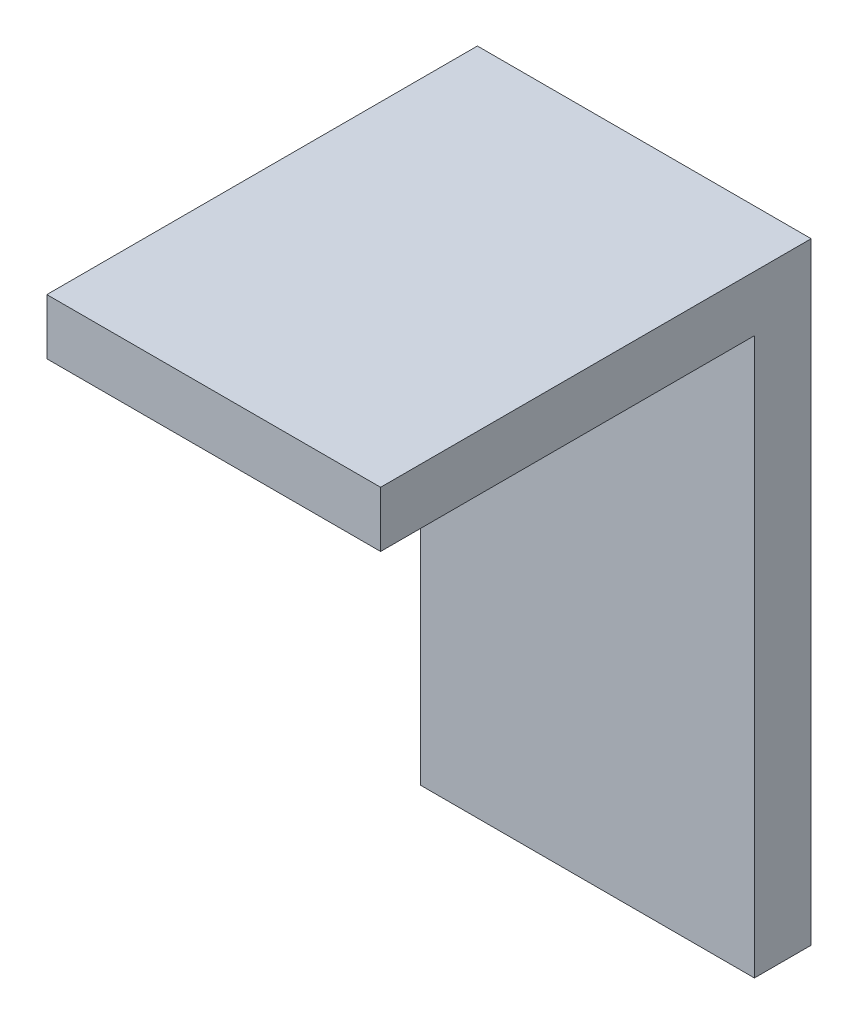
ISO-10303-21;
HEADER;
FILE_DESCRIPTION(('STEP AP214'),'2;1');
FILE_NAME('part.step','',(''),(''),'','','');
FILE_SCHEMA(('AUTOMOTIVE_DESIGN { 1 0 10303 214 1 1 1 1 }'));
ENDSEC;
DATA;
#1=APPLICATION_CONTEXT('core data for automotive mechanical design processes');
#2=APPLICATION_PROTOCOL_DEFINITION('international standard','automotive_design',2000,#1);
#3=PRODUCT_CONTEXT('',#1,'mechanical');
#4=PRODUCT('Part','Part','',(#3));
#5=PRODUCT_RELATED_PRODUCT_CATEGORY('part','',(#4));
#6=PRODUCT_DEFINITION_FORMATION('','',#4);
#7=PRODUCT_DEFINITION_CONTEXT('part definition',#1,'design');
#8=PRODUCT_DEFINITION('design','',#6,#7);
#9=PRODUCT_DEFINITION_SHAPE('','',#8);
#10=(LENGTH_UNIT() NAMED_UNIT(*) SI_UNIT(.MILLI.,.METRE.));
#11=(NAMED_UNIT(*) PLANE_ANGLE_UNIT() SI_UNIT($,.RADIAN.));
#12=(NAMED_UNIT(*) SI_UNIT($,.STERADIAN.) SOLID_ANGLE_UNIT());
#13=UNCERTAINTY_MEASURE_WITH_UNIT(LENGTH_MEASURE(1.E-05),#10,'distance_accuracy_value','');
#14=(GEOMETRIC_REPRESENTATION_CONTEXT(3) GLOBAL_UNCERTAINTY_ASSIGNED_CONTEXT((#13)) GLOBAL_UNIT_ASSIGNED_CONTEXT((#10,
#11,#12)) REPRESENTATION_CONTEXT('',''));
#15=CARTESIAN_POINT('',(0.,0.,0.));
#16=DIRECTION('',(0.,0.,1.));
#17=DIRECTION('',(1.,0.,0.));
#18=AXIS2_PLACEMENT_3D('',#15,#16,#17);
#19=CARTESIAN_POINT('',(-3.4,4.55,0.));
#20=DIRECTION('',(-1.,0.,0.));
#21=DIRECTION('',(0.,0.,1.));
#22=AXIS2_PLACEMENT_3D('',#19,#20,#21);
#23=PLANE('',#22);
#24=DIRECTION('',(0.,1.,0.));
#25=VECTOR('',#24,1.);
#26=CARTESIAN_POINT('',(-3.4,4.,0.));
#27=LINE('',#26,#25);
#28=CARTESIAN_POINT('',(-3.4,4.,0.));
#29=VERTEX_POINT('',#28);
#30=CARTESIAN_POINT('',(-3.4,4.55,0.));
#31=VERTEX_POINT('',#30);
#32=EDGE_CURVE('E11',#29,#31,#27,.T.);
#33=ORIENTED_EDGE('',*,*,#32,.F.);
#34=DIRECTION('',(0.,0.,-1.));
#35=VECTOR('',#34,1.);
#36=CARTESIAN_POINT('',(-3.4,4.,0.051));
#37=LINE('',#36,#35);
#38=CARTESIAN_POINT('',(-3.4,4.,0.051));
#39=VERTEX_POINT('',#38);
#40=EDGE_CURVE('E24',#39,#29,#37,.T.);
#41=ORIENTED_EDGE('',*,*,#40,.F.);
#42=DIRECTION('',(0.,-1.,0.));
#43=VECTOR('',#42,1.);
#44=CARTESIAN_POINT('',(-3.4,4.5,0.051));
#45=LINE('',#44,#43);
#46=CARTESIAN_POINT('',(-3.4,4.5,0.051));
#47=VERTEX_POINT('',#46);
#48=EDGE_CURVE('E87',#47,#39,#45,.T.);
#49=ORIENTED_EDGE('',*,*,#48,.F.);
#50=DIRECTION('',(0.,0.,-1.));
#51=VECTOR('',#50,1.);
#52=CARTESIAN_POINT('',(-3.4,4.5,0.387));
#53=LINE('',#52,#51);
#54=CARTESIAN_POINT('',(-3.4,4.5,0.387));
#55=VERTEX_POINT('',#54);
#56=EDGE_CURVE('E114',#55,#47,#53,.T.);
#57=ORIENTED_EDGE('',*,*,#56,.F.);
#58=DIRECTION('',(0.,-1.,0.));
#59=VECTOR('',#58,1.);
#60=CARTESIAN_POINT('',(-3.4,4.55,0.387));
#61=LINE('',#60,#59);
#62=CARTESIAN_POINT('',(-3.4,4.55,0.387));
#63=VERTEX_POINT('',#62);
#64=EDGE_CURVE('E111',#63,#55,#61,.T.);
#65=ORIENTED_EDGE('',*,*,#64,.F.);
#66=DIRECTION('',(0.,0.,1.));
#67=VECTOR('',#66,1.);
#68=CARTESIAN_POINT('',(-3.4,4.55,0.));
#69=LINE('',#68,#67);
#70=EDGE_CURVE('E108',#31,#63,#69,.T.);
#71=ORIENTED_EDGE('',*,*,#70,.F.);
#72=EDGE_LOOP('',(#33,#41,#49,#57,#65,#71));
#73=FACE_BOUND('',#72,.T.);
#74=ADVANCED_FACE('F17',(#73),#23,.T.);
#75=CARTESIAN_POINT('',(-3.1,4.,0.));
#76=DIRECTION('',(1.,0.,0.));
#77=DIRECTION('',(0.,0.,1.));
#78=AXIS2_PLACEMENT_3D('',#75,#76,#77);
#79=PLANE('',#78);
#80=DIRECTION('',(0.,-1.,0.));
#81=VECTOR('',#80,1.);
#82=CARTESIAN_POINT('',(-3.1,4.55,0.));
#83=LINE('',#82,#81);
#84=CARTESIAN_POINT('',(-3.1,4.55,0.));
#85=VERTEX_POINT('',#84);
#86=CARTESIAN_POINT('',(-3.1,4.,0.));
#87=VERTEX_POINT('',#86);
#88=EDGE_CURVE('E106',#85,#87,#83,.T.);
#89=ORIENTED_EDGE('',*,*,#88,.F.);
#90=DIRECTION('',(0.,0.,-1.));
#91=VECTOR('',#90,1.);
#92=CARTESIAN_POINT('',(-3.1,4.55,0.387));
#93=LINE('',#92,#91);
#94=CARTESIAN_POINT('',(-3.1,4.55,0.387));
#95=VERTEX_POINT('',#94);
#96=EDGE_CURVE('E103',#95,#85,#93,.T.);
#97=ORIENTED_EDGE('',*,*,#96,.F.);
#98=DIRECTION('',(0.,1.,0.));
#99=VECTOR('',#98,1.);
#100=CARTESIAN_POINT('',(-3.1,4.5,0.387));
#101=LINE('',#100,#99);
#102=CARTESIAN_POINT('',(-3.1,4.5,0.387));
#103=VERTEX_POINT('',#102);
#104=EDGE_CURVE('E100',#103,#95,#101,.T.);
#105=ORIENTED_EDGE('',*,*,#104,.F.);
#106=DIRECTION('',(0.,0.,1.));
#107=VECTOR('',#106,1.);
#108=CARTESIAN_POINT('',(-3.1,4.5,0.051));
#109=LINE('',#108,#107);
#110=CARTESIAN_POINT('',(-3.1,4.5,0.051));
#111=VERTEX_POINT('',#110);
#112=EDGE_CURVE('E72',#111,#103,#109,.T.);
#113=ORIENTED_EDGE('',*,*,#112,.F.);
#114=DIRECTION('',(0.,1.,0.));
#115=VECTOR('',#114,1.);
#116=CARTESIAN_POINT('',(-3.1,4.,0.051));
#117=LINE('',#116,#115);
#118=CARTESIAN_POINT('',(-3.1,4.,0.051));
#119=VERTEX_POINT('',#118);
#120=EDGE_CURVE('E66',#119,#111,#117,.T.);
#121=ORIENTED_EDGE('',*,*,#120,.F.);
#122=DIRECTION('',(0.,0.,1.));
#123=VECTOR('',#122,1.);
#124=CARTESIAN_POINT('',(-3.1,4.,0.));
#125=LINE('',#124,#123);
#126=EDGE_CURVE('E69',#87,#119,#125,.T.);
#127=ORIENTED_EDGE('',*,*,#126,.F.);
#128=EDGE_LOOP('',(#89,#97,#105,#113,#121,#127));
#129=FACE_BOUND('',#128,.T.);
#130=ADVANCED_FACE('F68',(#129),#79,.T.);
#131=CARTESIAN_POINT('',(-3.4,4.55,0.387));
#132=DIRECTION('',(0.,0.,1.));
#133=DIRECTION('',(0.,1.,0.));
#134=AXIS2_PLACEMENT_3D('',#131,#132,#133);
#135=PLANE('',#134);
#136=ORIENTED_EDGE('',*,*,#64,.T.);
#137=DIRECTION('',(-1.,0.,0.));
#138=VECTOR('',#137,1.);
#139=CARTESIAN_POINT('',(-3.1,4.5,0.387));
#140=LINE('',#139,#138);
#141=EDGE_CURVE('E83',#103,#55,#140,.T.);
#142=ORIENTED_EDGE('',*,*,#141,.F.);
#143=ORIENTED_EDGE('',*,*,#104,.T.);
#144=DIRECTION('',(1.,0.,0.));
#145=VECTOR('',#144,1.);
#146=CARTESIAN_POINT('',(-3.4,4.55,0.387));
#147=LINE('',#146,#145);
#148=EDGE_CURVE('E88',#63,#95,#147,.T.);
#149=ORIENTED_EDGE('',*,*,#148,.F.);
#150=EDGE_LOOP('',(#136,#142,#143,#149));
#151=FACE_BOUND('',#150,.T.);
#152=ADVANCED_FACE('F125',(#151),#135,.T.);
#153=CARTESIAN_POINT('',(-3.4,4.5,0.051));
#154=DIRECTION('',(0.,0.,1.));
#155=DIRECTION('',(0.,1.,0.));
#156=AXIS2_PLACEMENT_3D('',#153,#154,#155);
#157=PLANE('',#156);
#158=ORIENTED_EDGE('',*,*,#48,.T.);
#159=DIRECTION('',(-1.,0.,0.));
#160=VECTOR('',#159,1.);
#161=CARTESIAN_POINT('',(-3.1,4.,0.051));
#162=LINE('',#161,#160);
#163=EDGE_CURVE('E81',#119,#39,#162,.T.);
#164=ORIENTED_EDGE('',*,*,#163,.F.);
#165=ORIENTED_EDGE('',*,*,#120,.T.);
#166=DIRECTION('',(1.,0.,0.));
#167=VECTOR('',#166,1.);
#168=CARTESIAN_POINT('',(-3.4,4.5,0.051));
#169=LINE('',#168,#167);
#170=EDGE_CURVE('E89',#47,#111,#169,.T.);
#171=ORIENTED_EDGE('',*,*,#170,.F.);
#172=EDGE_LOOP('',(#158,#164,#165,#171));
#173=FACE_BOUND('',#172,.T.);
#174=ADVANCED_FACE('F86',(#173),#157,.T.);
#175=CARTESIAN_POINT('',(-3.1,4.55,0.));
#176=DIRECTION('',(0.,1.,0.));
#177=DIRECTION('',(0.,0.,1.));
#178=AXIS2_PLACEMENT_3D('',#175,#176,#177);
#179=PLANE('',#178);
#180=DIRECTION('',(1.,0.,0.));
#181=VECTOR('',#180,1.);
#182=CARTESIAN_POINT('',(-3.4,4.55,0.));
#183=LINE('',#182,#181);
#184=EDGE_CURVE('E93',#31,#85,#183,.T.);
#185=ORIENTED_EDGE('',*,*,#184,.F.);
#186=ORIENTED_EDGE('',*,*,#70,.T.);
#187=ORIENTED_EDGE('',*,*,#148,.T.);
#188=ORIENTED_EDGE('',*,*,#96,.T.);
#189=EDGE_LOOP('',(#185,#186,#187,#188));
#190=FACE_BOUND('',#189,.T.);
#191=ADVANCED_FACE('F121',(#190),#179,.T.);
#192=CARTESIAN_POINT('',(-3.4,4.,0.));
#193=DIRECTION('',(0.,-1.,0.));
#194=DIRECTION('',(0.,0.,1.));
#195=AXIS2_PLACEMENT_3D('',#192,#193,#194);
#196=PLANE('',#195);
#197=DIRECTION('',(-1.,0.,0.));
#198=VECTOR('',#197,1.);
#199=CARTESIAN_POINT('',(-3.1,4.,0.));
#200=LINE('',#199,#198);
#201=EDGE_CURVE('E82',#87,#29,#200,.T.);
#202=ORIENTED_EDGE('',*,*,#201,.F.);
#203=ORIENTED_EDGE('',*,*,#126,.T.);
#204=ORIENTED_EDGE('',*,*,#163,.T.);
#205=ORIENTED_EDGE('',*,*,#40,.T.);
#206=EDGE_LOOP('',(#202,#203,#204,#205));
#207=FACE_BOUND('',#206,.T.);
#208=ADVANCED_FACE('F80',(#207),#196,.T.);
#209=CARTESIAN_POINT('',(-3.4,4.5,0.051));
#210=DIRECTION('',(0.,-1.,0.));
#211=DIRECTION('',(0.,0.,1.));
#212=AXIS2_PLACEMENT_3D('',#209,#210,#211);
#213=PLANE('',#212);
#214=ORIENTED_EDGE('',*,*,#170,.T.);
#215=ORIENTED_EDGE('',*,*,#112,.T.);
#216=ORIENTED_EDGE('',*,*,#141,.T.);
#217=ORIENTED_EDGE('',*,*,#56,.T.);
#218=EDGE_LOOP('',(#214,#215,#216,#217));
#219=FACE_BOUND('',#218,.T.);
#220=ADVANCED_FACE('F127',(#219),#213,.T.);
#221=CARTESIAN_POINT('',(-3.1,4.55,0.));
#222=DIRECTION('',(0.,0.,-1.));
#223=DIRECTION('',(0.,1.,0.));
#224=AXIS2_PLACEMENT_3D('',#221,#222,#223);
#225=PLANE('',#224);
#226=ORIENTED_EDGE('',*,*,#88,.T.);
#227=ORIENTED_EDGE('',*,*,#201,.T.);
#228=ORIENTED_EDGE('',*,*,#32,.T.);
#229=ORIENTED_EDGE('',*,*,#184,.T.);
#230=EDGE_LOOP('',(#226,#227,#228,#229));
#231=FACE_BOUND('',#230,.T.);
#232=ADVANCED_FACE('F117',(#231),#225,.T.);
#233=CLOSED_SHELL('',(#74,#130,#152,#174,#191,#208,#220,#232));
#234=MANIFOLD_SOLID_BREP('B1',#233);
#235=ADVANCED_BREP_SHAPE_REPRESENTATION('',(#18,#234),#14);
#236=SHAPE_DEFINITION_REPRESENTATION(#9,#235);
ENDSEC;
END-ISO-10303-21;
